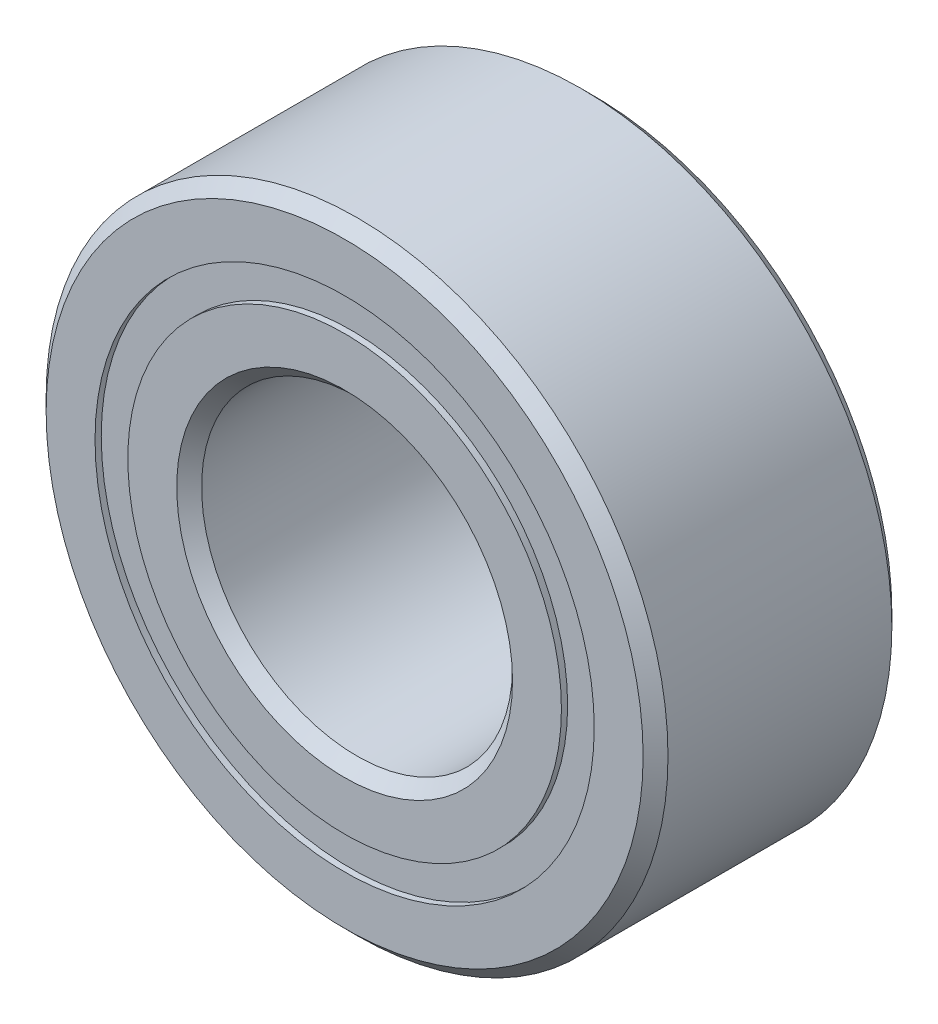
ISO-10303-21;
HEADER;
FILE_DESCRIPTION(('STEP AP214'),'2;1');
FILE_NAME('part.step','',(''),(''),'','','');
FILE_SCHEMA(('AUTOMOTIVE_DESIGN { 1 0 10303 214 1 1 1 1 }'));
ENDSEC;
DATA;
#1=APPLICATION_CONTEXT('core data for automotive mechanical design processes');
#2=APPLICATION_PROTOCOL_DEFINITION('international standard','automotive_design',2000,#1);
#3=PRODUCT_CONTEXT('',#1,'mechanical');
#4=PRODUCT('Part','Part','',(#3));
#5=PRODUCT_RELATED_PRODUCT_CATEGORY('part','',(#4));
#6=PRODUCT_DEFINITION_FORMATION('','',#4);
#7=PRODUCT_DEFINITION_CONTEXT('part definition',#1,'design');
#8=PRODUCT_DEFINITION('design','',#6,#7);
#9=PRODUCT_DEFINITION_SHAPE('','',#8);
#10=(LENGTH_UNIT() NAMED_UNIT(*) SI_UNIT(.MILLI.,.METRE.));
#11=(NAMED_UNIT(*) PLANE_ANGLE_UNIT() SI_UNIT($,.RADIAN.));
#12=(NAMED_UNIT(*) SI_UNIT($,.STERADIAN.) SOLID_ANGLE_UNIT());
#13=UNCERTAINTY_MEASURE_WITH_UNIT(LENGTH_MEASURE(1.E-05),#10,'distance_accuracy_value','');
#14=(GEOMETRIC_REPRESENTATION_CONTEXT(3) GLOBAL_UNCERTAINTY_ASSIGNED_CONTEXT((#13)) GLOBAL_UNIT_ASSIGNED_CONTEXT((#10,
#11,#12)) REPRESENTATION_CONTEXT('',''));
#15=CARTESIAN_POINT('',(0.,0.,0.));
#16=DIRECTION('',(0.,0.,1.));
#17=DIRECTION('',(1.,0.,0.));
#18=AXIS2_PLACEMENT_3D('',#15,#16,#17);
#19=CARTESIAN_POINT('',(0.,4.01373626373626,-1.9));
#20=DIRECTION('',(0.,0.,1.));
#21=DIRECTION('',(1.,0.,0.));
#22=AXIS2_PLACEMENT_3D('',#19,#20,#21);
#23=PLANE('',#22);
#24=CARTESIAN_POINT('',(0.,0.,-1.9));
#25=DIRECTION('',(0.,0.,1.));
#26=DIRECTION('',(1.,0.,0.));
#27=AXIS2_PLACEMENT_3D('',#24,#25,#26);
#28=CIRCLE('',#27,4.01373626373626);
#29=CARTESIAN_POINT('',(4.01373626373626,0.,-1.9));
#30=VERTEX_POINT('',#29);
#31=EDGE_CURVE('E55',#30,#30,#28,.T.);
#32=ORIENTED_EDGE('',*,*,#31,.F.);
#33=EDGE_LOOP('',(#32));
#34=FACE_BOUND('',#33,.T.);
#35=CARTESIAN_POINT('',(0.,0.,-1.9));
#36=DIRECTION('',(0.,0.,1.));
#37=DIRECTION('',(1.,0.,0.));
#38=AXIS2_PLACEMENT_3D('',#35,#36,#37);
#39=CIRCLE('',#38,3.48626373626374);
#40=CARTESIAN_POINT('',(3.48626373626374,0.,-1.9));
#41=VERTEX_POINT('',#40);
#42=EDGE_CURVE('E11',#41,#41,#39,.T.);
#43=ORIENTED_EDGE('',*,*,#42,.T.);
#44=EDGE_LOOP('',(#43));
#45=FACE_BOUND('',#44,.T.);
#46=ADVANCED_FACE('F41',(#34,#45),#23,.F.);
#47=CARTESIAN_POINT('',(0.,0.,2.));
#48=DIRECTION('',(0.,0.,1.));
#49=DIRECTION('',(1.,0.,0.));
#50=AXIS2_PLACEMENT_3D('',#47,#48,#49);
#51=CYLINDRICAL_SURFACE('',#50,3.48626373626374);
#52=ORIENTED_EDGE('',*,*,#42,.F.);
#53=EDGE_LOOP('',(#52));
#54=FACE_BOUND('',#53,.T.);
#55=CARTESIAN_POINT('',(0.,0.,-0.927189448602435));
#56=DIRECTION('',(0.,0.,1.));
#57=DIRECTION('',(1.,0.,0.));
#58=AXIS2_PLACEMENT_3D('',#55,#56,#57);
#59=CIRCLE('',#58,3.48626373626374);
#60=CARTESIAN_POINT('',(3.48626373626374,0.,-0.927189448602435));
#61=VERTEX_POINT('',#60);
#62=EDGE_CURVE('E47',#61,#61,#59,.T.);
#63=ORIENTED_EDGE('',*,*,#62,.T.);
#64=EDGE_LOOP('',(#63));
#65=FACE_BOUND('',#64,.T.);
#66=ADVANCED_FACE('F64',(#54,#65),#51,.F.);
#67=CARTESIAN_POINT('',(0.,4.01373626373626,-0.927189448602435));
#68=DIRECTION('',(0.,0.,-1.));
#69=DIRECTION('',(-1.,0.,0.));
#70=AXIS2_PLACEMENT_3D('',#67,#68,#69);
#71=PLANE('',#70);
#72=ORIENTED_EDGE('',*,*,#62,.F.);
#73=EDGE_LOOP('',(#72));
#74=FACE_BOUND('',#73,.T.);
#75=CARTESIAN_POINT('',(0.,0.,-0.927189448602435));
#76=DIRECTION('',(0.,0.,1.));
#77=DIRECTION('',(1.,0.,0.));
#78=AXIS2_PLACEMENT_3D('',#75,#76,#77);
#79=CIRCLE('',#78,4.01373626373626);
#80=CARTESIAN_POINT('',(4.01373626373626,0.,-0.927189448602435));
#81=VERTEX_POINT('',#80);
#82=EDGE_CURVE('E51',#81,#81,#79,.T.);
#83=ORIENTED_EDGE('',*,*,#82,.T.);
#84=EDGE_LOOP('',(#83));
#85=FACE_BOUND('',#84,.T.);
#86=ADVANCED_FACE('F68',(#74,#85),#71,.F.);
#87=CARTESIAN_POINT('',(0.,0.,2.));
#88=DIRECTION('',(0.,0.,1.));
#89=DIRECTION('',(1.,0.,0.));
#90=AXIS2_PLACEMENT_3D('',#87,#88,#89);
#91=CYLINDRICAL_SURFACE('',#90,4.01373626373626);
#92=ORIENTED_EDGE('',*,*,#82,.F.);
#93=EDGE_LOOP('',(#92));
#94=FACE_BOUND('',#93,.T.);
#95=ORIENTED_EDGE('',*,*,#31,.T.);
#96=EDGE_LOOP('',(#95));
#97=FACE_BOUND('',#96,.T.);
#98=ADVANCED_FACE('F61',(#94,#97),#91,.T.);
#99=CLOSED_SHELL('',(#46,#66,#86,#98));
#100=MANIFOLD_SOLID_BREP('B2',#99);
#101=CARTESIAN_POINT('',(0.,4.01373626373626,1.9));
#102=DIRECTION('',(0.,0.,-1.));
#103=DIRECTION('',(-1.,0.,0.));
#104=AXIS2_PLACEMENT_3D('',#101,#102,#103);
#105=PLANE('',#104);
#106=CARTESIAN_POINT('',(0.,0.,1.9));
#107=DIRECTION('',(0.,0.,1.));
#108=DIRECTION('',(1.,0.,0.));
#109=AXIS2_PLACEMENT_3D('',#106,#107,#108);
#110=CIRCLE('',#109,3.48626373626374);
#111=CARTESIAN_POINT('',(3.48626373626374,0.,1.9));
#112=VERTEX_POINT('',#111);
#113=EDGE_CURVE('E40',#112,#112,#110,.T.);
#114=ORIENTED_EDGE('',*,*,#113,.F.);
#115=EDGE_LOOP('',(#114));
#116=FACE_BOUND('',#115,.T.);
#117=CARTESIAN_POINT('',(0.,0.,1.9));
#118=DIRECTION('',(0.,0.,1.));
#119=DIRECTION('',(1.,0.,0.));
#120=AXIS2_PLACEMENT_3D('',#117,#118,#119);
#121=CIRCLE('',#120,4.01373626373626);
#122=CARTESIAN_POINT('',(4.01373626373626,0.,1.9));
#123=VERTEX_POINT('',#122);
#124=EDGE_CURVE('E122',#123,#123,#121,.T.);
#125=ORIENTED_EDGE('',*,*,#124,.T.);
#126=EDGE_LOOP('',(#125));
#127=FACE_BOUND('',#126,.T.);
#128=ADVANCED_FACE('F108',(#116,#127),#105,.F.);
#129=CARTESIAN_POINT('',(0.,0.,2.));
#130=DIRECTION('',(0.,0.,1.));
#131=DIRECTION('',(1.,0.,0.));
#132=AXIS2_PLACEMENT_3D('',#129,#130,#131);
#133=CYLINDRICAL_SURFACE('',#132,3.48626373626374);
#134=CARTESIAN_POINT('',(0.,0.,0.927189448602435));
#135=DIRECTION('',(0.,0.,1.));
#136=DIRECTION('',(1.,0.,0.));
#137=AXIS2_PLACEMENT_3D('',#134,#135,#136);
#138=CIRCLE('',#137,3.48626373626374);
#139=CARTESIAN_POINT('',(3.48626373626374,0.,0.927189448602435));
#140=VERTEX_POINT('',#139);
#141=EDGE_CURVE('E114',#140,#140,#138,.T.);
#142=ORIENTED_EDGE('',*,*,#141,.F.);
#143=EDGE_LOOP('',(#142));
#144=FACE_BOUND('',#143,.T.);
#145=ORIENTED_EDGE('',*,*,#113,.T.);
#146=EDGE_LOOP('',(#145));
#147=FACE_BOUND('',#146,.T.);
#148=ADVANCED_FACE('F137',(#144,#147),#133,.F.);
#149=CARTESIAN_POINT('',(0.,4.01373626373626,0.927189448602435));
#150=DIRECTION('',(0.,0.,1.));
#151=DIRECTION('',(1.,0.,0.));
#152=AXIS2_PLACEMENT_3D('',#149,#150,#151);
#153=PLANE('',#152);
#154=CARTESIAN_POINT('',(0.,0.,0.927189448602435));
#155=DIRECTION('',(0.,0.,1.));
#156=DIRECTION('',(1.,0.,0.));
#157=AXIS2_PLACEMENT_3D('',#154,#155,#156);
#158=CIRCLE('',#157,4.01373626373626);
#159=CARTESIAN_POINT('',(4.01373626373626,0.,0.927189448602435));
#160=VERTEX_POINT('',#159);
#161=EDGE_CURVE('E118',#160,#160,#158,.T.);
#162=ORIENTED_EDGE('',*,*,#161,.F.);
#163=EDGE_LOOP('',(#162));
#164=FACE_BOUND('',#163,.T.);
#165=ORIENTED_EDGE('',*,*,#141,.T.);
#166=EDGE_LOOP('',(#165));
#167=FACE_BOUND('',#166,.T.);
#168=ADVANCED_FACE('F132',(#164,#167),#153,.F.);
#169=CARTESIAN_POINT('',(0.,0.,2.));
#170=DIRECTION('',(0.,0.,1.));
#171=DIRECTION('',(1.,0.,0.));
#172=AXIS2_PLACEMENT_3D('',#169,#170,#171);
#173=CYLINDRICAL_SURFACE('',#172,4.01373626373626);
#174=ORIENTED_EDGE('',*,*,#124,.F.);
#175=EDGE_LOOP('',(#174));
#176=FACE_BOUND('',#175,.T.);
#177=ORIENTED_EDGE('',*,*,#161,.T.);
#178=EDGE_LOOP('',(#177));
#179=FACE_BOUND('',#178,.T.);
#180=ADVANCED_FACE('F129',(#176,#179),#173,.T.);
#181=CLOSED_SHELL('',(#128,#148,#168,#180));
#182=MANIFOLD_SOLID_BREP('B6',#181);
#183=CARTESIAN_POINT('',(-1.87499999999996,3.24759526419167,0.));
#184=DIRECTION('',(0.,0.,1.));
#185=DIRECTION('',(-0.499999999999989,0.866025403784445,0.));
#186=AXIS2_PLACEMENT_3D('',#183,#184,#185);
#187=SPHERICAL_SURFACE('',#186,0.927189448602435);
#188=CARTESIAN_POINT('',(-1.87499999999996,3.24759526419167,0.927189448602435));
#189=VERTEX_POINT('',#188);
#190=VERTEX_LOOP('',#189);
#191=FACE_BOUND('',#190,.T.);
#192=ADVANCED_FACE('F175',(#191),#187,.T.);
#193=CLOSED_SHELL('',(#192));
#194=MANIFOLD_SOLID_BREP('B35',#193);
#195=CARTESIAN_POINT('',(-3.24759526419162,1.87500000000004,0.));
#196=DIRECTION('',(0.,0.,1.));
#197=DIRECTION('',(-0.866025403784433,0.50000000000001,0.));
#198=AXIS2_PLACEMENT_3D('',#195,#196,#197);
#199=SPHERICAL_SURFACE('',#198,0.927189448602435);
#200=CARTESIAN_POINT('',(-3.24759526419162,1.87500000000004,0.927189448602435));
#201=VERTEX_POINT('',#200);
#202=VERTEX_LOOP('',#201);
#203=FACE_BOUND('',#202,.T.);
#204=ADVANCED_FACE('F195',(#203),#199,.T.);
#205=CLOSED_SHELL('',(#204));
#206=MANIFOLD_SOLID_BREP('B104',#205);
#207=CARTESIAN_POINT('',(-3.75,0.,0.));
#208=DIRECTION('',(0.,0.,1.));
#209=DIRECTION('',(-1.,0.,0.));
#210=AXIS2_PLACEMENT_3D('',#207,#208,#209);
#211=SPHERICAL_SURFACE('',#210,0.927189448602435);
#212=CARTESIAN_POINT('',(-3.75,0.,0.927189448602435));
#213=VERTEX_POINT('',#212);
#214=VERTEX_LOOP('',#213);
#215=FACE_BOUND('',#214,.T.);
#216=ADVANCED_FACE('F215',(#215),#211,.T.);
#217=CLOSED_SHELL('',(#216));
#218=MANIFOLD_SOLID_BREP('B171',#217);
#219=CARTESIAN_POINT('',(-3.24759526419166,-1.87499999999997,0.));
#220=DIRECTION('',(0.,0.,1.));
#221=DIRECTION('',(-0.866025403784443,-0.499999999999992,0.));
#222=AXIS2_PLACEMENT_3D('',#219,#220,#221);
#223=SPHERICAL_SURFACE('',#222,0.927189448602435);
#224=CARTESIAN_POINT('',(-3.24759526419166,-1.87499999999997,0.927189448602435));
#225=VERTEX_POINT('',#224);
#226=VERTEX_LOOP('',#225);
#227=FACE_BOUND('',#226,.T.);
#228=ADVANCED_FACE('F235',(#227),#223,.T.);
#229=CLOSED_SHELL('',(#228));
#230=MANIFOLD_SOLID_BREP('B191',#229);
#231=CARTESIAN_POINT('',(-1.87500000000003,-3.24759526419163,0.));
#232=DIRECTION('',(0.,0.,1.));
#233=DIRECTION('',(-0.500000000000007,-0.866025403784435,0.));
#234=AXIS2_PLACEMENT_3D('',#231,#232,#233);
#235=SPHERICAL_SURFACE('',#234,0.927189448602435);
#236=CARTESIAN_POINT('',(-1.87500000000003,-3.24759526419163,0.927189448602435));
#237=VERTEX_POINT('',#236);
#238=VERTEX_LOOP('',#237);
#239=FACE_BOUND('',#238,.T.);
#240=ADVANCED_FACE('F255',(#239),#235,.T.);
#241=CLOSED_SHELL('',(#240));
#242=MANIFOLD_SOLID_BREP('B211',#241);
#243=CARTESIAN_POINT('',(0.,-3.75,0.));
#244=DIRECTION('',(0.,0.,1.));
#245=DIRECTION('',(0.,-1.,0.));
#246=AXIS2_PLACEMENT_3D('',#243,#244,#245);
#247=SPHERICAL_SURFACE('',#246,0.927189448602435);
#248=CARTESIAN_POINT('',(0.,-3.75,0.927189448602435));
#249=VERTEX_POINT('',#248);
#250=VERTEX_LOOP('',#249);
#251=FACE_BOUND('',#250,.T.);
#252=ADVANCED_FACE('F275',(#251),#247,.T.);
#253=CLOSED_SHELL('',(#252));
#254=MANIFOLD_SOLID_BREP('B231',#253);
#255=CARTESIAN_POINT('',(1.87499999999998,-3.24759526419166,0.));
#256=DIRECTION('',(0.,0.,1.));
#257=DIRECTION('',(0.499999999999995,-0.866025403784442,0.));
#258=AXIS2_PLACEMENT_3D('',#255,#256,#257);
#259=SPHERICAL_SURFACE('',#258,0.927189448602435);
#260=CARTESIAN_POINT('',(1.87499999999998,-3.24759526419166,0.927189448602435));
#261=VERTEX_POINT('',#260);
#262=VERTEX_LOOP('',#261);
#263=FACE_BOUND('',#262,.T.);
#264=ADVANCED_FACE('F295',(#263),#259,.T.);
#265=CLOSED_SHELL('',(#264));
#266=MANIFOLD_SOLID_BREP('B251',#265);
#267=CARTESIAN_POINT('',(3.24759526419164,-1.87500000000002,0.));
#268=DIRECTION('',(0.,0.,1.));
#269=DIRECTION('',(0.866025403784436,-0.500000000000004,0.));
#270=AXIS2_PLACEMENT_3D('',#267,#268,#269);
#271=SPHERICAL_SURFACE('',#270,0.927189448602435);
#272=CARTESIAN_POINT('',(3.24759526419164,-1.87500000000002,0.927189448602435));
#273=VERTEX_POINT('',#272);
#274=VERTEX_LOOP('',#273);
#275=FACE_BOUND('',#274,.T.);
#276=ADVANCED_FACE('F315',(#275),#271,.T.);
#277=CLOSED_SHELL('',(#276));
#278=MANIFOLD_SOLID_BREP('B271',#277);
#279=CARTESIAN_POINT('',(3.75,0.,0.));
#280=DIRECTION('',(0.,0.,1.));
#281=DIRECTION('',(1.,0.,0.));
#282=AXIS2_PLACEMENT_3D('',#279,#280,#281);
#283=SPHERICAL_SURFACE('',#282,0.927189448602435);
#284=CARTESIAN_POINT('',(3.75,0.,0.927189448602435));
#285=VERTEX_POINT('',#284);
#286=VERTEX_LOOP('',#285);
#287=FACE_BOUND('',#286,.T.);
#288=ADVANCED_FACE('F335',(#287),#283,.T.);
#289=CLOSED_SHELL('',(#288));
#290=MANIFOLD_SOLID_BREP('B291',#289);
#291=CARTESIAN_POINT('',(3.24759526419165,1.87499999999999,0.));
#292=DIRECTION('',(0.,0.,1.));
#293=DIRECTION('',(0.86602540378444,0.499999999999998,0.));
#294=AXIS2_PLACEMENT_3D('',#291,#292,#293);
#295=SPHERICAL_SURFACE('',#294,0.927189448602435);
#296=CARTESIAN_POINT('',(3.24759526419165,1.87499999999999,0.927189448602435));
#297=VERTEX_POINT('',#296);
#298=VERTEX_LOOP('',#297);
#299=FACE_BOUND('',#298,.T.);
#300=ADVANCED_FACE('F355',(#299),#295,.T.);
#301=CLOSED_SHELL('',(#300));
#302=MANIFOLD_SOLID_BREP('B311',#301);
#303=CARTESIAN_POINT('',(1.875,3.24759526419164,0.));
#304=DIRECTION('',(0.,0.,1.));
#305=DIRECTION('',(0.500000000000001,0.866025403784438,0.));
#306=AXIS2_PLACEMENT_3D('',#303,#304,#305);
#307=SPHERICAL_SURFACE('',#306,0.927189448602435);
#308=CARTESIAN_POINT('',(1.875,3.24759526419164,0.927189448602435));
#309=VERTEX_POINT('',#308);
#310=VERTEX_LOOP('',#309);
#311=FACE_BOUND('',#310,.T.);
#312=ADVANCED_FACE('F375',(#311),#307,.T.);
#313=CLOSED_SHELL('',(#312));
#314=MANIFOLD_SOLID_BREP('B331',#313);
#315=CARTESIAN_POINT('',(0.,3.75,0.));
#316=DIRECTION('',(0.,0.,1.));
#317=DIRECTION('',(0.,1.,0.));
#318=AXIS2_PLACEMENT_3D('',#315,#316,#317);
#319=SPHERICAL_SURFACE('',#318,0.927189448602435);
#320=CARTESIAN_POINT('',(0.,3.75,0.927189448602435));
#321=VERTEX_POINT('',#320);
#322=VERTEX_LOOP('',#321);
#323=FACE_BOUND('',#322,.T.);
#324=ADVANCED_FACE('F397',(#323),#319,.T.);
#325=CLOSED_SHELL('',(#324));
#326=MANIFOLD_SOLID_BREP('B351',#325);
#327=CARTESIAN_POINT('',(0.,3.48626373626374,2.));
#328=DIRECTION('',(0.,0.,-1.));
#329=DIRECTION('',(-1.,0.,0.));
#330=AXIS2_PLACEMENT_3D('',#327,#328,#329);
#331=PLANE('',#330);
#332=CARTESIAN_POINT('',(0.,0.,2.));
#333=DIRECTION('',(0.,0.,1.));
#334=DIRECTION('',(1.,0.,0.));
#335=AXIS2_PLACEMENT_3D('',#332,#333,#334);
#336=CIRCLE('',#335,2.7);
#337=CARTESIAN_POINT('',(2.7,0.,2.));
#338=VERTEX_POINT('',#337);
#339=EDGE_CURVE('E444',#338,#338,#336,.T.);
#340=ORIENTED_EDGE('',*,*,#339,.F.);
#341=EDGE_LOOP('',(#340));
#342=FACE_BOUND('',#341,.T.);
#343=CARTESIAN_POINT('',(0.,0.,2.));
#344=DIRECTION('',(0.,0.,1.));
#345=DIRECTION('',(1.,0.,0.));
#346=AXIS2_PLACEMENT_3D('',#343,#344,#345);
#347=CIRCLE('',#346,3.48626373626374);
#348=CARTESIAN_POINT('',(3.48626373626374,0.,2.));
#349=VERTEX_POINT('',#348);
#350=EDGE_CURVE('E396',#349,#349,#347,.T.);
#351=ORIENTED_EDGE('',*,*,#350,.T.);
#352=EDGE_LOOP('',(#351));
#353=FACE_BOUND('',#352,.T.);
#354=ADVANCED_FACE('F416',(#342,#353),#331,.F.);
#355=CARTESIAN_POINT('',(0.,0.,2.));
#356=DIRECTION('',(0.,0.,1.));
#357=DIRECTION('',(1.,0.,0.));
#358=AXIS2_PLACEMENT_3D('',#355,#356,#357);
#359=CYLINDRICAL_SURFACE('',#358,3.48626373626374);
#360=ORIENTED_EDGE('',*,*,#350,.F.);
#361=EDGE_LOOP('',(#360));
#362=FACE_BOUND('',#361,.T.);
#363=CARTESIAN_POINT('',(0.,0.,0.888888888888889));
#364=DIRECTION('',(0.,0.,1.));
#365=DIRECTION('',(1.,0.,0.));
#366=AXIS2_PLACEMENT_3D('',#363,#364,#365);
#367=CIRCLE('',#366,3.48626373626374);
#368=CARTESIAN_POINT('',(3.48626373626374,0.,0.888888888888889));
#369=VERTEX_POINT('',#368);
#370=EDGE_CURVE('E422',#369,#369,#367,.T.);
#371=ORIENTED_EDGE('',*,*,#370,.T.);
#372=EDGE_LOOP('',(#371));
#373=FACE_BOUND('',#372,.T.);
#374=ADVANCED_FACE('F451',(#362,#373),#359,.T.);
#375=CARTESIAN_POINT('',(0.,0.,0.));
#376=DIRECTION('',(0.,0.,1.));
#377=DIRECTION('',(1.,0.,0.));
#378=AXIS2_PLACEMENT_3D('',#375,#376,#377);
#379=TOROIDAL_SURFACE('',#378,3.75,0.927189448602434);
#380=ORIENTED_EDGE('',*,*,#370,.F.);
#381=EDGE_LOOP('',(#380));
#382=FACE_BOUND('',#381,.T.);
#383=CARTESIAN_POINT('',(0.,0.,-0.88888888888889));
#384=DIRECTION('',(0.,0.,1.));
#385=DIRECTION('',(1.,0.,0.));
#386=AXIS2_PLACEMENT_3D('',#383,#384,#385);
#387=CIRCLE('',#386,3.48626373626374);
#388=CARTESIAN_POINT('',(3.48626373626374,0.,-0.88888888888889));
#389=VERTEX_POINT('',#388);
#390=EDGE_CURVE('E426',#389,#389,#387,.T.);
#391=ORIENTED_EDGE('',*,*,#390,.T.);
#392=EDGE_LOOP('',(#391));
#393=FACE_BOUND('',#392,.T.);
#394=ADVANCED_FACE('F455',(#382,#393),#379,.F.);
#395=CARTESIAN_POINT('',(0.,0.,2.));
#396=DIRECTION('',(0.,0.,1.));
#397=DIRECTION('',(1.,0.,0.));
#398=AXIS2_PLACEMENT_3D('',#395,#396,#397);
#399=CYLINDRICAL_SURFACE('',#398,3.48626373626374);
#400=ORIENTED_EDGE('',*,*,#390,.F.);
#401=EDGE_LOOP('',(#400));
#402=FACE_BOUND('',#401,.T.);
#403=CARTESIAN_POINT('',(0.,0.,-2.));
#404=DIRECTION('',(0.,0.,1.));
#405=DIRECTION('',(1.,0.,0.));
#406=AXIS2_PLACEMENT_3D('',#403,#404,#405);
#407=CIRCLE('',#406,3.48626373626374);
#408=CARTESIAN_POINT('',(3.48626373626374,0.,-2.));
#409=VERTEX_POINT('',#408);
#410=EDGE_CURVE('E430',#409,#409,#407,.T.);
#411=ORIENTED_EDGE('',*,*,#410,.T.);
#412=EDGE_LOOP('',(#411));
#413=FACE_BOUND('',#412,.T.);
#414=ADVANCED_FACE('F460',(#402,#413),#399,.T.);
#415=CARTESIAN_POINT('',(0.,2.7,-2.));
#416=DIRECTION('',(0.,0.,1.));
#417=DIRECTION('',(1.,0.,0.));
#418=AXIS2_PLACEMENT_3D('',#415,#416,#417);
#419=PLANE('',#418);
#420=ORIENTED_EDGE('',*,*,#410,.F.);
#421=EDGE_LOOP('',(#420));
#422=FACE_BOUND('',#421,.T.);
#423=CARTESIAN_POINT('',(0.,0.,-2.));
#424=DIRECTION('',(0.,0.,1.));
#425=DIRECTION('',(1.,0.,0.));
#426=AXIS2_PLACEMENT_3D('',#423,#424,#425);
#427=CIRCLE('',#426,2.7);
#428=CARTESIAN_POINT('',(2.7,0.,-2.));
#429=VERTEX_POINT('',#428);
#430=EDGE_CURVE('E435',#429,#429,#427,.T.);
#431=ORIENTED_EDGE('',*,*,#430,.T.);
#432=EDGE_LOOP('',(#431));
#433=FACE_BOUND('',#432,.T.);
#434=ADVANCED_FACE('F466',(#422,#433),#419,.F.);
#435=CARTESIAN_POINT('',(0.,0.,-1.8));
#436=DIRECTION('',(0.,0.,-1.));
#437=DIRECTION('',(-1.,0.,0.));
#438=AXIS2_PLACEMENT_3D('',#435,#436,#437);
#439=CONICAL_SURFACE('',#438,2.5,0.785398163397449);
#440=ORIENTED_EDGE('',*,*,#430,.F.);
#441=EDGE_LOOP('',(#440));
#442=FACE_BOUND('',#441,.T.);
#443=CARTESIAN_POINT('',(0.,0.,-1.8));
#444=DIRECTION('',(0.,0.,1.));
#445=DIRECTION('',(1.,0.,0.));
#446=AXIS2_PLACEMENT_3D('',#443,#444,#445);
#447=CIRCLE('',#446,2.5);
#448=CARTESIAN_POINT('',(2.5,0.,-1.8));
#449=VERTEX_POINT('',#448);
#450=EDGE_CURVE('E438',#449,#449,#447,.T.);
#451=ORIENTED_EDGE('',*,*,#450,.T.);
#452=EDGE_LOOP('',(#451));
#453=FACE_BOUND('',#452,.T.);
#454=ADVANCED_FACE('F470',(#442,#453),#439,.F.);
#455=CARTESIAN_POINT('',(0.,0.,2.));
#456=DIRECTION('',(0.,0.,1.));
#457=DIRECTION('',(1.,0.,0.));
#458=AXIS2_PLACEMENT_3D('',#455,#456,#457);
#459=CYLINDRICAL_SURFACE('',#458,2.5);
#460=ORIENTED_EDGE('',*,*,#450,.F.);
#461=EDGE_LOOP('',(#460));
#462=FACE_BOUND('',#461,.T.);
#463=CARTESIAN_POINT('',(0.,0.,1.8));
#464=DIRECTION('',(0.,0.,1.));
#465=DIRECTION('',(1.,0.,0.));
#466=AXIS2_PLACEMENT_3D('',#463,#464,#465);
#467=CIRCLE('',#466,2.5);
#468=CARTESIAN_POINT('',(2.5,0.,1.8));
#469=VERTEX_POINT('',#468);
#470=EDGE_CURVE('E441',#469,#469,#467,.T.);
#471=ORIENTED_EDGE('',*,*,#470,.T.);
#472=EDGE_LOOP('',(#471));
#473=FACE_BOUND('',#472,.T.);
#474=ADVANCED_FACE('F474',(#462,#473),#459,.F.);
#475=CARTESIAN_POINT('',(0.,0.,2.));
#476=DIRECTION('',(0.,0.,1.));
#477=DIRECTION('',(1.,0.,0.));
#478=AXIS2_PLACEMENT_3D('',#475,#476,#477);
#479=CONICAL_SURFACE('',#478,2.7,0.785398163397447);
#480=ORIENTED_EDGE('',*,*,#470,.F.);
#481=EDGE_LOOP('',(#480));
#482=FACE_BOUND('',#481,.T.);
#483=ORIENTED_EDGE('',*,*,#339,.T.);
#484=EDGE_LOOP('',(#483));
#485=FACE_BOUND('',#484,.T.);
#486=ADVANCED_FACE('F448',(#482,#485),#479,.F.);
#487=CLOSED_SHELL('',(#354,#374,#394,#414,#434,#454,#474,#486));
#488=MANIFOLD_SOLID_BREP('B371',#487);
#489=CARTESIAN_POINT('',(0.,0.,1.8));
#490=DIRECTION('',(0.,0.,-1.));
#491=DIRECTION('',(-1.,0.,0.));
#492=AXIS2_PLACEMENT_3D('',#489,#490,#491);
#493=CONICAL_SURFACE('',#492,5.,0.785398163397447);
#494=CARTESIAN_POINT('',(0.,0.,2.));
#495=DIRECTION('',(0.,0.,1.));
#496=DIRECTION('',(1.,0.,0.));
#497=AXIS2_PLACEMENT_3D('',#494,#495,#496);
#498=CIRCLE('',#497,4.8);
#499=CARTESIAN_POINT('',(4.8,0.,2.));
#500=VERTEX_POINT('',#499);
#501=EDGE_CURVE('E565',#500,#500,#498,.T.);
#502=ORIENTED_EDGE('',*,*,#501,.F.);
#503=EDGE_LOOP('',(#502));
#504=FACE_BOUND('',#503,.T.);
#505=CARTESIAN_POINT('',(0.,0.,1.8));
#506=DIRECTION('',(0.,0.,1.));
#507=DIRECTION('',(1.,0.,0.));
#508=AXIS2_PLACEMENT_3D('',#505,#506,#507);
#509=CIRCLE('',#508,5.);
#510=CARTESIAN_POINT('',(5.,0.,1.8));
#511=VERTEX_POINT('',#510);
#512=EDGE_CURVE('E415',#511,#511,#509,.T.);
#513=ORIENTED_EDGE('',*,*,#512,.T.);
#514=EDGE_LOOP('',(#513));
#515=FACE_BOUND('',#514,.T.);
#516=ADVANCED_FACE('F537',(#504,#515),#493,.T.);
#517=CARTESIAN_POINT('',(0.,0.,2.));
#518=DIRECTION('',(0.,0.,1.));
#519=DIRECTION('',(1.,0.,0.));
#520=AXIS2_PLACEMENT_3D('',#517,#518,#519);
#521=CYLINDRICAL_SURFACE('',#520,5.);
#522=ORIENTED_EDGE('',*,*,#512,.F.);
#523=EDGE_LOOP('',(#522));
#524=FACE_BOUND('',#523,.T.);
#525=CARTESIAN_POINT('',(0.,0.,-1.8));
#526=DIRECTION('',(0.,0.,1.));
#527=DIRECTION('',(1.,0.,0.));
#528=AXIS2_PLACEMENT_3D('',#525,#526,#527);
#529=CIRCLE('',#528,5.);
#530=CARTESIAN_POINT('',(5.,0.,-1.8));
#531=VERTEX_POINT('',#530);
#532=EDGE_CURVE('E543',#531,#531,#529,.T.);
#533=ORIENTED_EDGE('',*,*,#532,.T.);
#534=EDGE_LOOP('',(#533));
#535=FACE_BOUND('',#534,.T.);
#536=ADVANCED_FACE('F572',(#524,#535),#521,.T.);
#537=CARTESIAN_POINT('',(0.,0.,-2.));
#538=DIRECTION('',(0.,0.,1.));
#539=DIRECTION('',(1.,0.,0.));
#540=AXIS2_PLACEMENT_3D('',#537,#538,#539);
#541=CONICAL_SURFACE('',#540,4.8,0.785398163397448);
#542=ORIENTED_EDGE('',*,*,#532,.F.);
#543=EDGE_LOOP('',(#542));
#544=FACE_BOUND('',#543,.T.);
#545=CARTESIAN_POINT('',(0.,0.,-2.));
#546=DIRECTION('',(0.,0.,1.));
#547=DIRECTION('',(1.,0.,0.));
#548=AXIS2_PLACEMENT_3D('',#545,#546,#547);
#549=CIRCLE('',#548,4.8);
#550=CARTESIAN_POINT('',(4.8,0.,-2.));
#551=VERTEX_POINT('',#550);
#552=EDGE_CURVE('E547',#551,#551,#549,.T.);
#553=ORIENTED_EDGE('',*,*,#552,.T.);
#554=EDGE_LOOP('',(#553));
#555=FACE_BOUND('',#554,.T.);
#556=ADVANCED_FACE('F576',(#544,#555),#541,.T.);
#557=CARTESIAN_POINT('',(0.,4.8,-2.));
#558=DIRECTION('',(0.,0.,1.));
#559=DIRECTION('',(1.,0.,0.));
#560=AXIS2_PLACEMENT_3D('',#557,#558,#559);
#561=PLANE('',#560);
#562=ORIENTED_EDGE('',*,*,#552,.F.);
#563=EDGE_LOOP('',(#562));
#564=FACE_BOUND('',#563,.T.);
#565=CARTESIAN_POINT('',(0.,0.,-2.));
#566=DIRECTION('',(0.,0.,1.));
#567=DIRECTION('',(1.,0.,0.));
#568=AXIS2_PLACEMENT_3D('',#565,#566,#567);
#569=CIRCLE('',#568,4.01373626373626);
#570=CARTESIAN_POINT('',(4.01373626373626,0.,-2.));
#571=VERTEX_POINT('',#570);
#572=EDGE_CURVE('E551',#571,#571,#569,.T.);
#573=ORIENTED_EDGE('',*,*,#572,.T.);
#574=EDGE_LOOP('',(#573));
#575=FACE_BOUND('',#574,.T.);
#576=ADVANCED_FACE('F581',(#564,#575),#561,.F.);
#577=CARTESIAN_POINT('',(0.,0.,2.));
#578=DIRECTION('',(0.,0.,1.));
#579=DIRECTION('',(1.,0.,0.));
#580=AXIS2_PLACEMENT_3D('',#577,#578,#579);
#581=CYLINDRICAL_SURFACE('',#580,4.01373626373626);
#582=ORIENTED_EDGE('',*,*,#572,.F.);
#583=EDGE_LOOP('',(#582));
#584=FACE_BOUND('',#583,.T.);
#585=CARTESIAN_POINT('',(0.,0.,-0.888888888888889));
#586=DIRECTION('',(0.,0.,1.));
#587=DIRECTION('',(1.,0.,0.));
#588=AXIS2_PLACEMENT_3D('',#585,#586,#587);
#589=CIRCLE('',#588,4.01373626373626);
#590=CARTESIAN_POINT('',(4.01373626373626,0.,-0.888888888888889));
#591=VERTEX_POINT('',#590);
#592=EDGE_CURVE('E556',#591,#591,#589,.T.);
#593=ORIENTED_EDGE('',*,*,#592,.T.);
#594=EDGE_LOOP('',(#593));
#595=FACE_BOUND('',#594,.T.);
#596=ADVANCED_FACE('F587',(#584,#595),#581,.F.);
#597=CARTESIAN_POINT('',(0.,0.,0.));
#598=DIRECTION('',(0.,0.,1.));
#599=DIRECTION('',(1.,0.,0.));
#600=AXIS2_PLACEMENT_3D('',#597,#598,#599);
#601=TOROIDAL_SURFACE('',#600,3.75,0.927189448602435);
#602=ORIENTED_EDGE('',*,*,#592,.F.);
#603=EDGE_LOOP('',(#602));
#604=FACE_BOUND('',#603,.T.);
#605=CARTESIAN_POINT('',(0.,0.,0.888888888888889));
#606=DIRECTION('',(0.,0.,1.));
#607=DIRECTION('',(1.,0.,0.));
#608=AXIS2_PLACEMENT_3D('',#605,#606,#607);
#609=CIRCLE('',#608,4.01373626373626);
#610=CARTESIAN_POINT('',(4.01373626373626,0.,0.888888888888889));
#611=VERTEX_POINT('',#610);
#612=EDGE_CURVE('E559',#611,#611,#609,.T.);
#613=ORIENTED_EDGE('',*,*,#612,.T.);
#614=EDGE_LOOP('',(#613));
#615=FACE_BOUND('',#614,.T.);
#616=ADVANCED_FACE('F591',(#604,#615),#601,.F.);
#617=CARTESIAN_POINT('',(0.,0.,2.));
#618=DIRECTION('',(0.,0.,1.));
#619=DIRECTION('',(1.,0.,0.));
#620=AXIS2_PLACEMENT_3D('',#617,#618,#619);
#621=CYLINDRICAL_SURFACE('',#620,4.01373626373626);
#622=ORIENTED_EDGE('',*,*,#612,.F.);
#623=EDGE_LOOP('',(#622));
#624=FACE_BOUND('',#623,.T.);
#625=CARTESIAN_POINT('',(0.,0.,2.));
#626=DIRECTION('',(0.,0.,1.));
#627=DIRECTION('',(1.,0.,0.));
#628=AXIS2_PLACEMENT_3D('',#625,#626,#627);
#629=CIRCLE('',#628,4.01373626373626);
#630=CARTESIAN_POINT('',(4.01373626373626,0.,2.));
#631=VERTEX_POINT('',#630);
#632=EDGE_CURVE('E562',#631,#631,#629,.T.);
#633=ORIENTED_EDGE('',*,*,#632,.T.);
#634=EDGE_LOOP('',(#633));
#635=FACE_BOUND('',#634,.T.);
#636=ADVANCED_FACE('F595',(#624,#635),#621,.F.);
#637=CARTESIAN_POINT('',(0.,4.8,2.));
#638=DIRECTION('',(0.,0.,-1.));
#639=DIRECTION('',(-1.,0.,0.));
#640=AXIS2_PLACEMENT_3D('',#637,#638,#639);
#641=PLANE('',#640);
#642=ORIENTED_EDGE('',*,*,#632,.F.);
#643=EDGE_LOOP('',(#642));
#644=FACE_BOUND('',#643,.T.);
#645=ORIENTED_EDGE('',*,*,#501,.T.);
#646=EDGE_LOOP('',(#645));
#647=FACE_BOUND('',#646,.T.);
#648=ADVANCED_FACE('F569',(#644,#647),#641,.F.);
#649=CLOSED_SHELL('',(#516,#536,#556,#576,#596,#616,#636,#648));
#650=MANIFOLD_SOLID_BREP('B391',#649);
#651=ADVANCED_BREP_SHAPE_REPRESENTATION('',(#18,#100,#182,#194,#206,#218,#230,#242,#254,#266,
#278,#290,#302,#314,#326,#488,#650),#14);
#652=SHAPE_DEFINITION_REPRESENTATION(#9,#651);
ENDSEC;
END-ISO-10303-21;
